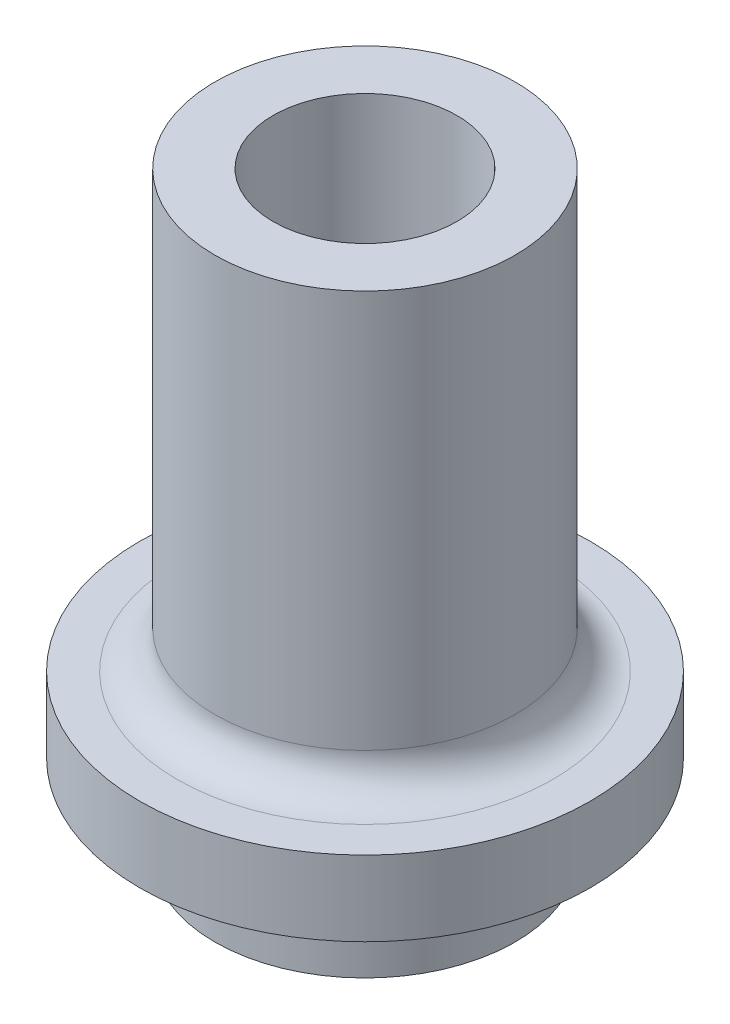
ISO-10303-21;
HEADER;
FILE_DESCRIPTION(('STEP AP214'),'2;1');
FILE_NAME('part.step','',(''),(''),'','','');
FILE_SCHEMA(('AUTOMOTIVE_DESIGN { 1 0 10303 214 1 1 1 1 }'));
ENDSEC;
DATA;
#1=APPLICATION_CONTEXT('core data for automotive mechanical design processes');
#2=APPLICATION_PROTOCOL_DEFINITION('international standard','automotive_design',2000,#1);
#3=PRODUCT_CONTEXT('',#1,'mechanical');
#4=PRODUCT('Part','Part','',(#3));
#5=PRODUCT_RELATED_PRODUCT_CATEGORY('part','',(#4));
#6=PRODUCT_DEFINITION_FORMATION('','',#4);
#7=PRODUCT_DEFINITION_CONTEXT('part definition',#1,'design');
#8=PRODUCT_DEFINITION('design','',#6,#7);
#9=PRODUCT_DEFINITION_SHAPE('','',#8);
#10=(LENGTH_UNIT() NAMED_UNIT(*) SI_UNIT(.MILLI.,.METRE.));
#11=(NAMED_UNIT(*) PLANE_ANGLE_UNIT() SI_UNIT($,.RADIAN.));
#12=(NAMED_UNIT(*) SI_UNIT($,.STERADIAN.) SOLID_ANGLE_UNIT());
#13=UNCERTAINTY_MEASURE_WITH_UNIT(LENGTH_MEASURE(1.E-05),#10,'distance_accuracy_value','');
#14=(GEOMETRIC_REPRESENTATION_CONTEXT(3) GLOBAL_UNCERTAINTY_ASSIGNED_CONTEXT((#13)) GLOBAL_UNIT_ASSIGNED_CONTEXT((#10,
#11,#12)) REPRESENTATION_CONTEXT('',''));
#15=CARTESIAN_POINT('',(0.,0.,0.));
#16=DIRECTION('',(0.,0.,1.));
#17=DIRECTION('',(1.,0.,0.));
#18=AXIS2_PLACEMENT_3D('',#15,#16,#17);
#19=CARTESIAN_POINT('',(0.,9.25,0.));
#20=DIRECTION('',(0.,-1.,0.));
#21=DIRECTION('',(0.,0.,-1.));
#22=AXIS2_PLACEMENT_3D('',#19,#20,#21);
#23=CYLINDRICAL_SURFACE('',#22,4.);
#24=CARTESIAN_POINT('',(0.,0.,0.));
#25=DIRECTION('',(0.,1.,0.));
#26=DIRECTION('',(0.,0.,1.));
#27=AXIS2_PLACEMENT_3D('',#24,#25,#26);
#28=CIRCLE('',#27,4.);
#29=CARTESIAN_POINT('',(0.,0.,4.));
#30=VERTEX_POINT('',#29);
#31=EDGE_CURVE('E76',#30,#30,#28,.T.);
#32=ORIENTED_EDGE('',*,*,#31,.T.);
#33=EDGE_LOOP('',(#32));
#34=FACE_BOUND('',#33,.T.);
#35=CARTESIAN_POINT('',(0.,2.25000000000003,0.));
#36=DIRECTION('',(0.,1.,0.));
#37=DIRECTION('',(0.,0.,1.));
#38=AXIS2_PLACEMENT_3D('',#35,#36,#37);
#39=CIRCLE('',#38,4.);
#40=CARTESIAN_POINT('',(0.,2.25000000000003,4.));
#41=VERTEX_POINT('',#40);
#42=EDGE_CURVE('E85',#41,#41,#39,.T.);
#43=ORIENTED_EDGE('',*,*,#42,.F.);
#44=EDGE_LOOP('',(#43));
#45=FACE_BOUND('',#44,.T.);
#46=ADVANCED_FACE('F35',(#34,#45),#23,.T.);
#47=CARTESIAN_POINT('',(0.,0.,0.));
#48=DIRECTION('',(0.,1.,0.));
#49=DIRECTION('',(0.,0.,1.));
#50=AXIS2_PLACEMENT_3D('',#47,#48,#49);
#51=PLANE('',#50);
#52=ORIENTED_EDGE('',*,*,#31,.F.);
#53=EDGE_LOOP('',(#52));
#54=FACE_BOUND('',#53,.T.);
#55=CARTESIAN_POINT('',(0.,0.,0.));
#56=DIRECTION('',(0.,1.,0.));
#57=DIRECTION('',(0.,0.,1.));
#58=AXIS2_PLACEMENT_3D('',#55,#56,#57);
#59=CIRCLE('',#58,1.62);
#60=CARTESIAN_POINT('',(-1.12,0.,-1.17046999107196));
#61=VERTEX_POINT('',#60);
#62=CARTESIAN_POINT('',(1.12,0.,-1.17046999107196));
#63=VERTEX_POINT('',#62);
#64=EDGE_CURVE('E73',#61,#63,#59,.T.);
#65=ORIENTED_EDGE('',*,*,#64,.T.);
#66=DIRECTION('',(-1.,0.,0.));
#67=VECTOR('',#66,1.);
#68=CARTESIAN_POINT('',(-1.12,0.,-1.17046999107196));
#69=LINE('',#68,#67);
#70=EDGE_CURVE('E66',#63,#61,#69,.T.);
#71=ORIENTED_EDGE('',*,*,#70,.T.);
#72=EDGE_LOOP('',(#65,#71));
#73=FACE_BOUND('',#72,.T.);
#74=ADVANCED_FACE('F104',(#54,#73),#51,.F.);
#75=CARTESIAN_POINT('',(0.,9.25,0.));
#76=DIRECTION('',(0.,-1.,0.));
#77=DIRECTION('',(0.,0.,-1.));
#78=AXIS2_PLACEMENT_3D('',#75,#76,#77);
#79=CYLINDRICAL_SURFACE('',#78,1.62);
#80=DIRECTION('',(0.,-1.,0.));
#81=VECTOR('',#80,1.);
#82=CARTESIAN_POINT('',(1.12,9.25,-1.17046999107196));
#83=LINE('',#82,#81);
#84=CARTESIAN_POINT('',(1.12,9.25,-1.17046999107196));
#85=VERTEX_POINT('',#84);
#86=EDGE_CURVE('E69',#85,#63,#83,.T.);
#87=ORIENTED_EDGE('',*,*,#86,.T.);
#88=ORIENTED_EDGE('',*,*,#64,.F.);
#89=DIRECTION('',(0.,-1.,0.));
#90=VECTOR('',#89,1.);
#91=CARTESIAN_POINT('',(-1.12,9.25,-1.17046999107196));
#92=LINE('',#91,#90);
#93=CARTESIAN_POINT('',(-1.12,9.25,-1.17046999107196));
#94=VERTEX_POINT('',#93);
#95=EDGE_CURVE('E56',#94,#61,#92,.T.);
#96=ORIENTED_EDGE('',*,*,#95,.F.);
#97=CARTESIAN_POINT('',(0.,9.25,0.));
#98=DIRECTION('',(0.,1.,0.));
#99=DIRECTION('',(0.,0.,1.));
#100=AXIS2_PLACEMENT_3D('',#97,#98,#99);
#101=CIRCLE('',#100,1.62);
#102=EDGE_CURVE('E63',#94,#85,#101,.T.);
#103=ORIENTED_EDGE('',*,*,#102,.T.);
#104=EDGE_LOOP('',(#87,#88,#96,#103));
#105=FACE_BOUND('',#104,.T.);
#106=ADVANCED_FACE('F71',(#105),#79,.F.);
#107=CARTESIAN_POINT('',(-1.12,9.25,-1.17046999107196));
#108=DIRECTION('',(0.,0.,1.));
#109=DIRECTION('',(1.,0.,0.));
#110=AXIS2_PLACEMENT_3D('',#107,#108,#109);
#111=PLANE('',#110);
#112=ORIENTED_EDGE('',*,*,#95,.T.);
#113=ORIENTED_EDGE('',*,*,#70,.F.);
#114=ORIENTED_EDGE('',*,*,#86,.F.);
#115=DIRECTION('',(-1.,0.,0.));
#116=VECTOR('',#115,1.);
#117=CARTESIAN_POINT('',(-1.12,9.25,-1.17046999107196));
#118=LINE('',#117,#116);
#119=EDGE_CURVE('E49',#85,#94,#118,.T.);
#120=ORIENTED_EDGE('',*,*,#119,.T.);
#121=EDGE_LOOP('',(#112,#113,#114,#120));
#122=FACE_BOUND('',#121,.T.);
#123=ADVANCED_FACE('F68',(#122),#111,.T.);
#124=CARTESIAN_POINT('',(0.,9.25,0.));
#125=DIRECTION('',(0.,1.,0.));
#126=DIRECTION('',(0.,0.,1.));
#127=AXIS2_PLACEMENT_3D('',#124,#125,#126);
#128=PLANE('',#127);
#129=ORIENTED_EDGE('',*,*,#119,.F.);
#130=ORIENTED_EDGE('',*,*,#102,.F.);
#131=EDGE_LOOP('',(#129,#130));
#132=FACE_BOUND('',#131,.T.);
#133=ADVANCED_FACE('F64',(#132),#128,.F.);
#134=CARTESIAN_POINT('',(0.,4.25000000000003,0.));
#135=DIRECTION('',(0.,1.,0.));
#136=DIRECTION('',(0.,0.,1.));
#137=AXIS2_PLACEMENT_3D('',#134,#135,#136);
#138=PLANE('',#137);
#139=CARTESIAN_POINT('',(0.,4.25000000000003,0.));
#140=DIRECTION('',(0.,1.,0.));
#141=DIRECTION('',(0.,0.,1.));
#142=AXIS2_PLACEMENT_3D('',#139,#140,#141);
#143=CIRCLE('',#142,5.);
#144=CARTESIAN_POINT('',(0.,4.25000000000003,5.));
#145=VERTEX_POINT('',#144);
#146=EDGE_CURVE('E11',#145,#145,#143,.F.);
#147=ORIENTED_EDGE('',*,*,#146,.T.);
#148=EDGE_LOOP('',(#147));
#149=FACE_BOUND('',#148,.T.);
#150=CARTESIAN_POINT('',(0.,4.25000000000003,0.));
#151=DIRECTION('',(0.,1.,0.));
#152=DIRECTION('',(0.,0.,1.));
#153=AXIS2_PLACEMENT_3D('',#150,#151,#152);
#154=CIRCLE('',#153,6.);
#155=CARTESIAN_POINT('',(0.,4.25000000000003,6.));
#156=VERTEX_POINT('',#155);
#157=EDGE_CURVE('E101',#156,#156,#154,.T.);
#158=ORIENTED_EDGE('',*,*,#157,.T.);
#159=EDGE_LOOP('',(#158));
#160=FACE_BOUND('',#159,.T.);
#161=ADVANCED_FACE('F149',(#149,#160),#138,.T.);
#162=CARTESIAN_POINT('',(0.,2.25000000000003,0.));
#163=DIRECTION('',(0.,1.,0.));
#164=DIRECTION('',(0.,0.,1.));
#165=AXIS2_PLACEMENT_3D('',#162,#163,#164);
#166=PLANE('',#165);
#167=CARTESIAN_POINT('',(0.,2.25000000000003,0.));
#168=DIRECTION('',(0.,1.,0.));
#169=DIRECTION('',(0.,0.,1.));
#170=AXIS2_PLACEMENT_3D('',#167,#168,#169);
#171=CIRCLE('',#170,6.);
#172=CARTESIAN_POINT('',(0.,2.25000000000003,6.));
#173=VERTEX_POINT('',#172);
#174=EDGE_CURVE('E95',#173,#173,#171,.T.);
#175=ORIENTED_EDGE('',*,*,#174,.F.);
#176=EDGE_LOOP('',(#175));
#177=FACE_BOUND('',#176,.T.);
#178=ORIENTED_EDGE('',*,*,#42,.T.);
#179=EDGE_LOOP('',(#178));
#180=FACE_BOUND('',#179,.T.);
#181=ADVANCED_FACE('F144',(#177,#180),#166,.F.);
#182=CARTESIAN_POINT('',(0.,4.25000000000003,0.));
#183=DIRECTION('',(0.,-1.,0.));
#184=DIRECTION('',(0.,0.,-1.));
#185=AXIS2_PLACEMENT_3D('',#182,#183,#184);
#186=CYLINDRICAL_SURFACE('',#185,6.);
#187=ORIENTED_EDGE('',*,*,#157,.F.);
#188=EDGE_LOOP('',(#187));
#189=FACE_BOUND('',#188,.T.);
#190=ORIENTED_EDGE('',*,*,#174,.T.);
#191=EDGE_LOOP('',(#190));
#192=FACE_BOUND('',#191,.T.);
#193=ADVANCED_FACE('F139',(#189,#192),#186,.T.);
#194=CARTESIAN_POINT('',(0.,10.25,0.));
#195=DIRECTION('',(0.,1.,0.));
#196=DIRECTION('',(0.,0.,1.));
#197=AXIS2_PLACEMENT_3D('',#194,#195,#196);
#198=PLANE('',#197);
#199=CARTESIAN_POINT('',(0.,10.25,0.));
#200=DIRECTION('',(0.,1.,0.));
#201=DIRECTION('',(0.,0.,1.));
#202=AXIS2_PLACEMENT_3D('',#199,#200,#201);
#203=CIRCLE('',#202,2.45);
#204=CARTESIAN_POINT('',(0.,10.25,2.45));
#205=VERTEX_POINT('',#204);
#206=EDGE_CURVE('E83',#205,#205,#203,.F.);
#207=ORIENTED_EDGE('',*,*,#206,.F.);
#208=EDGE_LOOP('',(#207));
#209=FACE_BOUND('',#208,.T.);
#210=ADVANCED_FACE('F134',(#209),#198,.T.);
#211=CARTESIAN_POINT('',(0.,15.85,0.));
#212=DIRECTION('',(0.,-1.,0.));
#213=DIRECTION('',(0.,0.,-1.));
#214=AXIS2_PLACEMENT_3D('',#211,#212,#213);
#215=CYLINDRICAL_SURFACE('',#214,2.45);
#216=CARTESIAN_POINT('',(0.,15.85,0.));
#217=DIRECTION('',(0.,1.,0.));
#218=DIRECTION('',(0.,0.,1.));
#219=AXIS2_PLACEMENT_3D('',#216,#217,#218);
#220=CIRCLE('',#219,2.45);
#221=CARTESIAN_POINT('',(0.,15.85,2.45));
#222=VERTEX_POINT('',#221);
#223=EDGE_CURVE('E97',#222,#222,#220,.T.);
#224=ORIENTED_EDGE('',*,*,#223,.T.);
#225=EDGE_LOOP('',(#224));
#226=FACE_BOUND('',#225,.T.);
#227=ORIENTED_EDGE('',*,*,#206,.T.);
#228=EDGE_LOOP('',(#227));
#229=FACE_BOUND('',#228,.T.);
#230=ADVANCED_FACE('F124',(#226,#229),#215,.F.);
#231=CARTESIAN_POINT('',(0.,15.85,0.));
#232=DIRECTION('',(0.,1.,0.));
#233=DIRECTION('',(0.,0.,1.));
#234=AXIS2_PLACEMENT_3D('',#231,#232,#233);
#235=PLANE('',#234);
#236=CARTESIAN_POINT('',(0.,15.85,0.));
#237=DIRECTION('',(0.,1.,0.));
#238=DIRECTION('',(0.,0.,1.));
#239=AXIS2_PLACEMENT_3D('',#236,#237,#238);
#240=CIRCLE('',#239,4.);
#241=CARTESIAN_POINT('',(0.,15.85,4.));
#242=VERTEX_POINT('',#241);
#243=EDGE_CURVE('E100',#242,#242,#240,.T.);
#244=ORIENTED_EDGE('',*,*,#243,.T.);
#245=EDGE_LOOP('',(#244));
#246=FACE_BOUND('',#245,.T.);
#247=ORIENTED_EDGE('',*,*,#223,.F.);
#248=EDGE_LOOP('',(#247));
#249=FACE_BOUND('',#248,.T.);
#250=ADVANCED_FACE('F118',(#246,#249),#235,.T.);
#251=CARTESIAN_POINT('',(0.,5.25000000000003,0.));
#252=DIRECTION('',(0.,1.,0.));
#253=DIRECTION('',(0.,0.,1.));
#254=AXIS2_PLACEMENT_3D('',#251,#252,#253);
#255=CIRCLE('',#254,4.);
#256=CARTESIAN_POINT('',(0.,5.25000000000003,4.));
#257=VERTEX_POINT('',#256);
#258=EDGE_CURVE('E43',#257,#257,#255,.T.);
#259=ORIENTED_EDGE('',*,*,#258,.T.);
#260=EDGE_LOOP('',(#259));
#261=FACE_BOUND('',#260,.T.);
#262=ORIENTED_EDGE('',*,*,#243,.F.);
#263=EDGE_LOOP('',(#262));
#264=FACE_BOUND('',#263,.T.);
#265=ADVANCED_FACE('F114',(#261,#264),#23,.T.);
#266=CARTESIAN_POINT('',(0.,5.25000000000003,0.));
#267=DIRECTION('',(0.,1.,0.));
#268=DIRECTION('',(0.,0.,1.));
#269=AXIS2_PLACEMENT_3D('',#266,#267,#268);
#270=TOROIDAL_SURFACE('',#269,5.,1.);
#271=ORIENTED_EDGE('',*,*,#146,.F.);
#272=EDGE_LOOP('',(#271));
#273=FACE_BOUND('',#272,.T.);
#274=ORIENTED_EDGE('',*,*,#258,.F.);
#275=EDGE_LOOP('',(#274));
#276=FACE_BOUND('',#275,.T.);
#277=ADVANCED_FACE('F37',(#273,#276),#270,.F.);
#278=CLOSED_SHELL('',(#46,#74,#106,#123,#133,#161,#181,#193,#210,#230,#250,#265,#277));
#279=MANIFOLD_SOLID_BREP('B2',#278);
#280=ADVANCED_BREP_SHAPE_REPRESENTATION('',(#18,#279),#14);
#281=SHAPE_DEFINITION_REPRESENTATION(#9,#280);
ENDSEC;
END-ISO-10303-21;
